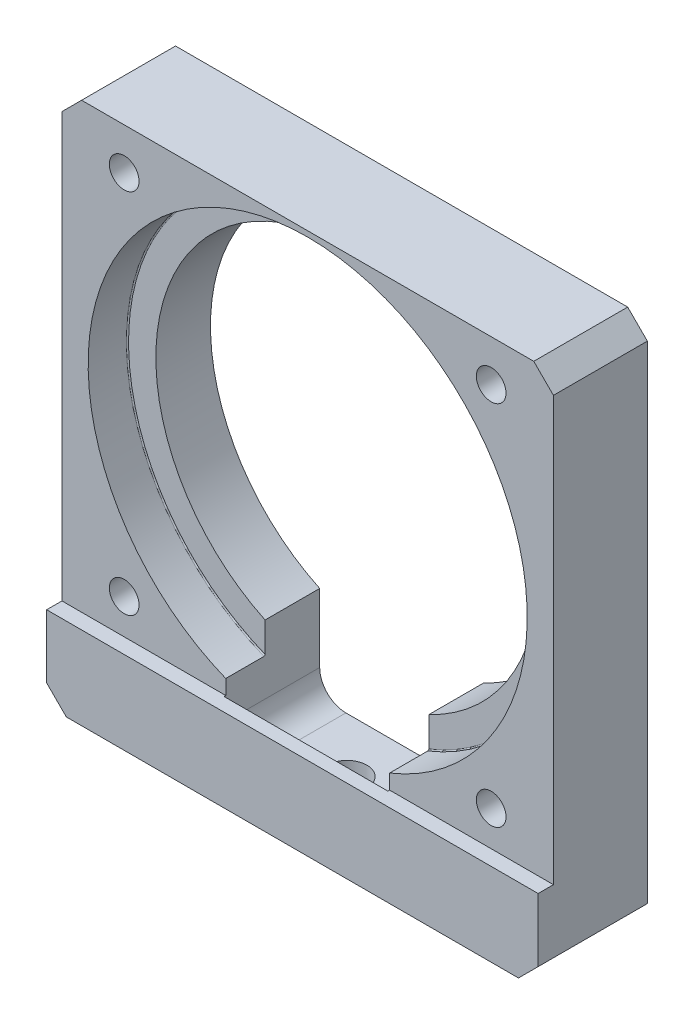
ISO-10303-21;
HEADER;
FILE_DESCRIPTION(('STEP AP214'),'2;1');
FILE_NAME('part.step','',(''),(''),'','','');
FILE_SCHEMA(('AUTOMOTIVE_DESIGN { 1 0 10303 214 1 1 1 1 }'));
ENDSEC;
DATA;
#1=APPLICATION_CONTEXT('core data for automotive mechanical design processes');
#2=APPLICATION_PROTOCOL_DEFINITION('international standard','automotive_design',2000,#1);
#3=PRODUCT_CONTEXT('',#1,'mechanical');
#4=PRODUCT('Part','Part','',(#3));
#5=PRODUCT_RELATED_PRODUCT_CATEGORY('part','',(#4));
#6=PRODUCT_DEFINITION_FORMATION('','',#4);
#7=PRODUCT_DEFINITION_CONTEXT('part definition',#1,'design');
#8=PRODUCT_DEFINITION('design','',#6,#7);
#9=PRODUCT_DEFINITION_SHAPE('','',#8);
#10=(LENGTH_UNIT() NAMED_UNIT(*) SI_UNIT(.MILLI.,.METRE.));
#11=(NAMED_UNIT(*) PLANE_ANGLE_UNIT() SI_UNIT($,.RADIAN.));
#12=(NAMED_UNIT(*) SI_UNIT($,.STERADIAN.) SOLID_ANGLE_UNIT());
#13=UNCERTAINTY_MEASURE_WITH_UNIT(LENGTH_MEASURE(1.E-05),#10,'distance_accuracy_value','');
#14=(GEOMETRIC_REPRESENTATION_CONTEXT(3) GLOBAL_UNCERTAINTY_ASSIGNED_CONTEXT((#13)) GLOBAL_UNIT_ASSIGNED_CONTEXT((#10,
#11,#12)) REPRESENTATION_CONTEXT('',''));
#15=CARTESIAN_POINT('',(0.,0.,0.));
#16=DIRECTION('',(0.,0.,1.));
#17=DIRECTION('',(1.,0.,0.));
#18=AXIS2_PLACEMENT_3D('',#15,#16,#17);
#19=CARTESIAN_POINT('',(0.,61.214,-6.35));
#20=DIRECTION('',(0.,0.,-1.));
#21=DIRECTION('',(-1.,0.,0.));
#22=AXIS2_PLACEMENT_3D('',#19,#20,#21);
#23=PLANE('',#22);
#24=DIRECTION('',(0.,1.,0.));
#25=VECTOR('',#24,1.);
#26=CARTESIAN_POINT('',(19.05,7.0104,-6.35));
#27=LINE('',#26,#25);
#28=CARTESIAN_POINT('',(19.05,7.0104,-6.35));
#29=VERTEX_POINT('',#28);
#30=CARTESIAN_POINT('',(19.05,14.9715368579308,-6.35));
#31=VERTEX_POINT('',#30);
#32=EDGE_CURVE('E436',#29,#31,#27,.T.);
#33=ORIENTED_EDGE('',*,*,#32,.F.);
#34=CARTESIAN_POINT('',(22.098,7.0104,-6.35));
#35=DIRECTION('',(0.,0.,-1.));
#36=DIRECTION('',(-1.,0.,0.));
#37=AXIS2_PLACEMENT_3D('',#34,#35,#36);
#38=CIRCLE('',#37,3.048);
#39=CARTESIAN_POINT('',(22.098,3.9624,-6.35));
#40=VERTEX_POINT('',#39);
#41=EDGE_CURVE('E441',#40,#29,#38,.T.);
#42=ORIENTED_EDGE('',*,*,#41,.F.);
#43=DIRECTION('',(-1.,0.,0.));
#44=VECTOR('',#43,1.);
#45=CARTESIAN_POINT('',(35.052,3.9624,-6.35));
#46=LINE('',#45,#44);
#47=CARTESIAN_POINT('',(35.052,3.96240000000001,-6.35));
#48=VERTEX_POINT('',#47);
#49=EDGE_CURVE('E460',#48,#40,#46,.T.);
#50=ORIENTED_EDGE('',*,*,#49,.F.);
#51=CARTESIAN_POINT('',(35.052,7.0104,-6.35));
#52=DIRECTION('',(0.,0.,-1.));
#53=DIRECTION('',(-1.,0.,0.));
#54=AXIS2_PLACEMENT_3D('',#51,#52,#53);
#55=CIRCLE('',#54,3.04799999999999);
#56=CARTESIAN_POINT('',(38.1,7.0104,-6.35));
#57=VERTEX_POINT('',#56);
#58=EDGE_CURVE('E457',#57,#48,#55,.T.);
#59=ORIENTED_EDGE('',*,*,#58,.F.);
#60=DIRECTION('',(0.,-1.,0.));
#61=VECTOR('',#60,1.);
#62=CARTESIAN_POINT('',(38.1,7.0104,-6.35));
#63=LINE('',#62,#61);
#64=CARTESIAN_POINT('',(38.1,14.9715368579308,-6.35));
#65=VERTEX_POINT('',#64);
#66=EDGE_CURVE('E455',#65,#57,#63,.T.);
#67=ORIENTED_EDGE('',*,*,#66,.F.);
#68=CARTESIAN_POINT('',(28.575,35.052,-6.35));
#69=DIRECTION('',(0.,0.,1.));
#70=DIRECTION('',(1.,0.,0.));
#71=AXIS2_PLACEMENT_3D('',#68,#69,#70);
#72=CIRCLE('',#71,22.225);
#73=EDGE_CURVE('E365',#65,#31,#72,.T.);
#74=ORIENTED_EDGE('',*,*,#73,.T.);
#75=EDGE_LOOP('',(#33,#42,#50,#59,#67,#74));
#76=FACE_BOUND('',#75,.T.);
#77=CARTESIAN_POINT('',(49.911,13.716,-6.35));
#78=DIRECTION('',(0.,0.,1.));
#79=DIRECTION('',(1.,0.,0.));
#80=AXIS2_PLACEMENT_3D('',#77,#78,#79);
#81=CIRCLE('',#80,1.7272);
#82=CARTESIAN_POINT('',(51.6382,13.716,-6.35));
#83=VERTEX_POINT('',#82);
#84=EDGE_CURVE('E418',#83,#83,#81,.T.);
#85=ORIENTED_EDGE('',*,*,#84,.T.);
#86=EDGE_LOOP('',(#85));
#87=FACE_BOUND('',#86,.T.);
#88=CARTESIAN_POINT('',(7.239,13.716,-6.35));
#89=DIRECTION('',(0.,0.,1.));
#90=DIRECTION('',(1.,0.,0.));
#91=AXIS2_PLACEMENT_3D('',#88,#89,#90);
#92=CIRCLE('',#91,1.7272);
#93=CARTESIAN_POINT('',(8.9662,13.716,-6.35));
#94=VERTEX_POINT('',#93);
#95=EDGE_CURVE('E412',#94,#94,#92,.T.);
#96=ORIENTED_EDGE('',*,*,#95,.T.);
#97=EDGE_LOOP('',(#96));
#98=FACE_BOUND('',#97,.T.);
#99=CARTESIAN_POINT('',(49.911,56.388,-6.35));
#100=DIRECTION('',(0.,0.,1.));
#101=DIRECTION('',(1.,0.,0.));
#102=AXIS2_PLACEMENT_3D('',#99,#100,#101);
#103=CIRCLE('',#102,1.7272);
#104=CARTESIAN_POINT('',(51.6382,56.388,-6.35));
#105=VERTEX_POINT('',#104);
#106=EDGE_CURVE('E406',#105,#105,#103,.T.);
#107=ORIENTED_EDGE('',*,*,#106,.T.);
#108=EDGE_LOOP('',(#107));
#109=FACE_BOUND('',#108,.T.);
#110=CARTESIAN_POINT('',(7.23899999999999,56.388,-6.35));
#111=DIRECTION('',(0.,0.,1.));
#112=DIRECTION('',(1.,0.,0.));
#113=AXIS2_PLACEMENT_3D('',#110,#111,#112);
#114=CIRCLE('',#113,1.7272);
#115=CARTESIAN_POINT('',(8.96619999999999,56.388,-6.35));
#116=VERTEX_POINT('',#115);
#117=EDGE_CURVE('E400',#116,#116,#114,.T.);
#118=ORIENTED_EDGE('',*,*,#117,.T.);
#119=EDGE_LOOP('',(#118));
#120=FACE_BOUND('',#119,.T.);
#121=DIRECTION('',(0.,1.,0.));
#122=VECTOR('',#121,1.);
#123=CARTESIAN_POINT('',(57.15,0.,-6.35));
#124=LINE('',#123,#122);
#125=CARTESIAN_POINT('',(57.15,2.286,-6.35));
#126=VERTEX_POINT('',#125);
#127=CARTESIAN_POINT('',(57.15,58.928,-6.35));
#128=VERTEX_POINT('',#127);
#129=EDGE_CURVE('E213',#126,#128,#124,.T.);
#130=ORIENTED_EDGE('',*,*,#129,.F.);
#131=DIRECTION('',(1.,0.,0.));
#132=VECTOR('',#131,1.);
#133=CARTESIAN_POINT('',(0.,2.286,-6.35));
#134=LINE('',#133,#132);
#135=CARTESIAN_POINT('',(0.,2.286,-6.35));
#136=VERTEX_POINT('',#135);
#137=EDGE_CURVE('E198',#136,#126,#134,.T.);
#138=ORIENTED_EDGE('',*,*,#137,.F.);
#139=DIRECTION('',(0.,-1.,0.));
#140=VECTOR('',#139,1.);
#141=CARTESIAN_POINT('',(0.,0.,-6.35));
#142=LINE('',#141,#140);
#143=CARTESIAN_POINT('',(0.,58.928,-6.35));
#144=VERTEX_POINT('',#143);
#145=EDGE_CURVE('E211',#144,#136,#142,.T.);
#146=ORIENTED_EDGE('',*,*,#145,.F.);
#147=DIRECTION('',(-0.707106781186549,-0.707106781186546,0.));
#148=VECTOR('',#147,1.);
#149=CARTESIAN_POINT('',(1.14299999999999,60.071,-6.35));
#150=LINE('',#149,#148);
#151=CARTESIAN_POINT('',(2.286,61.214,-6.35));
#152=VERTEX_POINT('',#151);
#153=EDGE_CURVE('E253',#144,#152,#150,.F.);
#154=ORIENTED_EDGE('',*,*,#153,.T.);
#155=DIRECTION('',(-1.,0.,0.));
#156=VECTOR('',#155,1.);
#157=CARTESIAN_POINT('',(0.,61.214,-6.35));
#158=LINE('',#157,#156);
#159=CARTESIAN_POINT('',(54.864,61.214,-6.35));
#160=VERTEX_POINT('',#159);
#161=EDGE_CURVE('E224',#160,#152,#158,.T.);
#162=ORIENTED_EDGE('',*,*,#161,.F.);
#163=DIRECTION('',(-0.707106781186545,0.70710678118655,0.));
#164=VECTOR('',#163,1.);
#165=CARTESIAN_POINT('',(27.4320000000002,88.646,-6.35));
#166=LINE('',#165,#164);
#167=EDGE_CURVE('E255',#160,#128,#166,.F.);
#168=ORIENTED_EDGE('',*,*,#167,.T.);
#169=EDGE_LOOP('',(#130,#138,#146,#154,#162,#168));
#170=FACE_BOUND('',#169,.T.);
#171=ADVANCED_FACE('F44',(#76,#87,#98,#109,#120,#170),#23,.T.);
#172=CARTESIAN_POINT('',(28.575,35.052,4.572));
#173=DIRECTION('',(0.,0.,1.));
#174=DIRECTION('',(1.,0.,0.));
#175=AXIS2_PLACEMENT_3D('',#172,#173,#174);
#176=CYLINDRICAL_SURFACE('',#175,22.225);
#177=CARTESIAN_POINT('',(28.575,35.052,0.));
#178=DIRECTION('',(0.,0.,1.));
#179=DIRECTION('',(1.,0.,0.));
#180=AXIS2_PLACEMENT_3D('',#177,#178,#179);
#181=CIRCLE('',#180,22.225);
#182=CARTESIAN_POINT('',(19.05,14.9715368579308,0.));
#183=VERTEX_POINT('',#182);
#184=CARTESIAN_POINT('',(38.1,14.9715368579308,0.));
#185=VERTEX_POINT('',#184);
#186=EDGE_CURVE('E424',#183,#185,#181,.F.);
#187=ORIENTED_EDGE('',*,*,#186,.F.);
#188=DIRECTION('',(0.,0.,1.));
#189=VECTOR('',#188,1.);
#190=CARTESIAN_POINT('',(19.05,14.9715368579308,4.572));
#191=LINE('',#190,#189);
#192=EDGE_CURVE('E239',#183,#31,#191,.F.);
#193=ORIENTED_EDGE('',*,*,#192,.T.);
#194=ORIENTED_EDGE('',*,*,#73,.F.);
#195=DIRECTION('',(0.,0.,1.));
#196=VECTOR('',#195,1.);
#197=CARTESIAN_POINT('',(38.1,14.9715368579308,4.572));
#198=LINE('',#197,#196);
#199=EDGE_CURVE('E236',#65,#185,#198,.T.);
#200=ORIENTED_EDGE('',*,*,#199,.T.);
#201=EDGE_LOOP('',(#187,#193,#194,#200));
#202=FACE_BOUND('',#201,.T.);
#203=ADVANCED_FACE('F292',(#202),#176,.F.);
#204=CARTESIAN_POINT('',(0.,61.214,6.35));
#205=DIRECTION('',(0.,-1.,0.));
#206=DIRECTION('',(0.,0.,-1.));
#207=AXIS2_PLACEMENT_3D('',#204,#205,#206);
#208=PLANE('',#207);
#209=DIRECTION('',(-1.,0.,0.));
#210=VECTOR('',#209,1.);
#211=CARTESIAN_POINT('',(0.,61.214,4.572));
#212=LINE('',#211,#210);
#213=CARTESIAN_POINT('',(54.864,61.214,4.572));
#214=VERTEX_POINT('',#213);
#215=CARTESIAN_POINT('',(2.286,61.214,4.572));
#216=VERTEX_POINT('',#215);
#217=EDGE_CURVE('E356',#214,#216,#212,.T.);
#218=ORIENTED_EDGE('',*,*,#217,.F.);
#219=DIRECTION('',(0.,0.,-1.));
#220=VECTOR('',#219,1.);
#221=CARTESIAN_POINT('',(54.864,61.214,6.35));
#222=LINE('',#221,#220);
#223=EDGE_CURVE('E250',#214,#160,#222,.T.);
#224=ORIENTED_EDGE('',*,*,#223,.T.);
#225=ORIENTED_EDGE('',*,*,#161,.T.);
#226=DIRECTION('',(0.,0.,1.));
#227=VECTOR('',#226,1.);
#228=CARTESIAN_POINT('',(2.286,61.214,6.35));
#229=LINE('',#228,#227);
#230=EDGE_CURVE('E248',#152,#216,#229,.T.);
#231=ORIENTED_EDGE('',*,*,#230,.T.);
#232=EDGE_LOOP('',(#218,#224,#225,#231));
#233=FACE_BOUND('',#232,.T.);
#234=ADVANCED_FACE('F295',(#233),#208,.F.);
#235=CARTESIAN_POINT('',(0.,0.,6.35));
#236=DIRECTION('',(1.,0.,0.));
#237=DIRECTION('',(0.,1.,0.));
#238=AXIS2_PLACEMENT_3D('',#235,#236,#237);
#239=PLANE('',#238);
#240=ORIENTED_EDGE('',*,*,#145,.T.);
#241=DIRECTION('',(0.,0.,1.));
#242=VECTOR('',#241,1.);
#243=CARTESIAN_POINT('',(0.,2.28600000000002,6.35));
#244=LINE('',#243,#242);
#245=CARTESIAN_POINT('',(0.,2.28600000000002,-3.175));
#246=VERTEX_POINT('',#245);
#247=EDGE_CURVE('E195',#136,#246,#244,.T.);
#248=ORIENTED_EDGE('',*,*,#247,.T.);
#249=CARTESIAN_POINT('',(0.,2.28600000000002,6.35));
#250=VERTEX_POINT('',#249);
#251=EDGE_CURVE('E206',#246,#250,#244,.T.);
#252=ORIENTED_EDGE('',*,*,#251,.T.);
#253=DIRECTION('',(0.,-1.,0.));
#254=VECTOR('',#253,1.);
#255=CARTESIAN_POINT('',(0.,0.,6.35));
#256=LINE('',#255,#254);
#257=CARTESIAN_POINT('',(0.,9.652,6.35));
#258=VERTEX_POINT('',#257);
#259=EDGE_CURVE('E235',#258,#250,#256,.T.);
#260=ORIENTED_EDGE('',*,*,#259,.F.);
#261=DIRECTION('',(0.,0.,1.));
#262=VECTOR('',#261,1.);
#263=CARTESIAN_POINT('',(0.,9.65200000000001,4.572));
#264=LINE('',#263,#262);
#265=CARTESIAN_POINT('',(0.,9.65200000000001,4.572));
#266=VERTEX_POINT('',#265);
#267=EDGE_CURVE('E227',#266,#258,#264,.T.);
#268=ORIENTED_EDGE('',*,*,#267,.F.);
#269=DIRECTION('',(0.,-1.,0.));
#270=VECTOR('',#269,1.);
#271=CARTESIAN_POINT('',(0.,61.214,4.572));
#272=LINE('',#271,#270);
#273=CARTESIAN_POINT('',(0.,58.928,4.572));
#274=VERTEX_POINT('',#273);
#275=EDGE_CURVE('E353',#274,#266,#272,.T.);
#276=ORIENTED_EDGE('',*,*,#275,.F.);
#277=DIRECTION('',(0.,0.,-1.));
#278=VECTOR('',#277,1.);
#279=CARTESIAN_POINT('',(0.,58.928,6.35));
#280=LINE('',#279,#278);
#281=EDGE_CURVE('E221',#274,#144,#280,.T.);
#282=ORIENTED_EDGE('',*,*,#281,.T.);
#283=EDGE_LOOP('',(#240,#248,#252,#260,#268,#276,#282));
#284=FACE_BOUND('',#283,.T.);
#285=ADVANCED_FACE('F218',(#284),#239,.F.);
#286=CARTESIAN_POINT('',(0.,0.,6.35));
#287=DIRECTION('',(0.,1.,0.));
#288=DIRECTION('',(0.,0.,1.));
#289=AXIS2_PLACEMENT_3D('',#286,#287,#288);
#290=PLANE('',#289);
#291=CARTESIAN_POINT('',(28.575,0.,0.));
#292=DIRECTION('',(0.,1.,0.));
#293=DIRECTION('',(0.,0.,1.));
#294=AXIS2_PLACEMENT_3D('',#291,#292,#293);
#295=CIRCLE('',#294,2.3114);
#296=CARTESIAN_POINT('',(28.575,0.,2.31139999999999));
#297=VERTEX_POINT('',#296);
#298=EDGE_CURVE('E433',#297,#297,#295,.T.);
#299=ORIENTED_EDGE('',*,*,#298,.T.);
#300=EDGE_LOOP('',(#299));
#301=FACE_BOUND('',#300,.T.);
#302=DIRECTION('',(0.,0.,-1.));
#303=VECTOR('',#302,1.);
#304=CARTESIAN_POINT('',(2.28600000000001,0.,6.35));
#305=LINE('',#304,#303);
#306=CARTESIAN_POINT('',(2.28600000000001,0.,6.35));
#307=VERTEX_POINT('',#306);
#308=CARTESIAN_POINT('',(2.28600000000001,0.,-3.175));
#309=VERTEX_POINT('',#308);
#310=EDGE_CURVE('E266',#307,#309,#305,.T.);
#311=ORIENTED_EDGE('',*,*,#310,.T.);
#312=DIRECTION('',(-1.,0.,0.));
#313=VECTOR('',#312,1.);
#314=CARTESIAN_POINT('',(0.,0.,-3.175));
#315=LINE('',#314,#313);
#316=CARTESIAN_POINT('',(54.864,0.,-3.175));
#317=VERTEX_POINT('',#316);
#318=EDGE_CURVE('E215',#317,#309,#315,.T.);
#319=ORIENTED_EDGE('',*,*,#318,.F.);
#320=DIRECTION('',(0.,0.,1.));
#321=VECTOR('',#320,1.);
#322=CARTESIAN_POINT('',(54.864,0.,6.35));
#323=LINE('',#322,#321);
#324=CARTESIAN_POINT('',(54.864,0.,6.35));
#325=VERTEX_POINT('',#324);
#326=EDGE_CURVE('E269',#317,#325,#323,.T.);
#327=ORIENTED_EDGE('',*,*,#326,.T.);
#328=DIRECTION('',(1.,0.,0.));
#329=VECTOR('',#328,1.);
#330=CARTESIAN_POINT('',(0.,0.,6.35));
#331=LINE('',#330,#329);
#332=EDGE_CURVE('E375',#307,#325,#331,.T.);
#333=ORIENTED_EDGE('',*,*,#332,.F.);
#334=EDGE_LOOP('',(#311,#319,#327,#333));
#335=FACE_BOUND('',#334,.T.);
#336=ADVANCED_FACE('F318',(#301,#335),#290,.F.);
#337=CARTESIAN_POINT('',(57.15,0.,6.35));
#338=DIRECTION('',(-1.,0.,0.));
#339=DIRECTION('',(0.,-1.,0.));
#340=AXIS2_PLACEMENT_3D('',#337,#338,#339);
#341=PLANE('',#340);
#342=ORIENTED_EDGE('',*,*,#129,.T.);
#343=DIRECTION('',(0.,0.,1.));
#344=VECTOR('',#343,1.);
#345=CARTESIAN_POINT('',(57.15,58.928,6.35));
#346=LINE('',#345,#344);
#347=CARTESIAN_POINT('',(57.15,58.928,4.572));
#348=VERTEX_POINT('',#347);
#349=EDGE_CURVE('E260',#128,#348,#346,.T.);
#350=ORIENTED_EDGE('',*,*,#349,.T.);
#351=DIRECTION('',(0.,1.,0.));
#352=VECTOR('',#351,1.);
#353=CARTESIAN_POINT('',(57.15,61.214,4.572));
#354=LINE('',#353,#352);
#355=CARTESIAN_POINT('',(57.15,9.65200000000001,4.572));
#356=VERTEX_POINT('',#355);
#357=EDGE_CURVE('E370',#356,#348,#354,.T.);
#358=ORIENTED_EDGE('',*,*,#357,.F.);
#359=DIRECTION('',(0.,0.,1.));
#360=VECTOR('',#359,1.);
#361=CARTESIAN_POINT('',(57.15,9.65200000000001,4.572));
#362=LINE('',#361,#360);
#363=CARTESIAN_POINT('',(57.15,9.65200000000001,6.35));
#364=VERTEX_POINT('',#363);
#365=EDGE_CURVE('E222',#356,#364,#362,.T.);
#366=ORIENTED_EDGE('',*,*,#365,.T.);
#367=DIRECTION('',(0.,1.,0.));
#368=VECTOR('',#367,1.);
#369=CARTESIAN_POINT('',(57.15,0.,6.35));
#370=LINE('',#369,#368);
#371=CARTESIAN_POINT('',(57.15,2.286,6.35));
#372=VERTEX_POINT('',#371);
#373=EDGE_CURVE('E230',#372,#364,#370,.T.);
#374=ORIENTED_EDGE('',*,*,#373,.F.);
#375=DIRECTION('',(0.,0.,-1.));
#376=VECTOR('',#375,1.);
#377=CARTESIAN_POINT('',(57.15,2.286,6.35));
#378=LINE('',#377,#376);
#379=CARTESIAN_POINT('',(57.15,2.286,-3.175));
#380=VERTEX_POINT('',#379);
#381=EDGE_CURVE('E257',#372,#380,#378,.T.);
#382=ORIENTED_EDGE('',*,*,#381,.T.);
#383=DIRECTION('',(0.,0.,1.));
#384=VECTOR('',#383,1.);
#385=CARTESIAN_POINT('',(57.15,2.286,-3.175));
#386=LINE('',#385,#384);
#387=EDGE_CURVE('E214',#126,#380,#386,.T.);
#388=ORIENTED_EDGE('',*,*,#387,.F.);
#389=EDGE_LOOP('',(#342,#350,#358,#366,#374,#382,#388));
#390=FACE_BOUND('',#389,.T.);
#391=ADVANCED_FACE('F308',(#390),#341,.F.);
#392=CARTESIAN_POINT('',(0.,61.214,6.35));
#393=DIRECTION('',(0.,0.,-1.));
#394=DIRECTION('',(-1.,0.,0.));
#395=AXIS2_PLACEMENT_3D('',#392,#393,#394);
#396=PLANE('',#395);
#397=ORIENTED_EDGE('',*,*,#332,.T.);
#398=DIRECTION('',(-0.707106781186549,-0.707106781186546,0.));
#399=VECTOR('',#398,1.);
#400=CARTESIAN_POINT('',(57.15,2.286,6.35));
#401=LINE('',#400,#399);
#402=EDGE_CURVE('E273',#325,#372,#401,.F.);
#403=ORIENTED_EDGE('',*,*,#402,.T.);
#404=ORIENTED_EDGE('',*,*,#373,.T.);
#405=DIRECTION('',(1.,0.,0.));
#406=VECTOR('',#405,1.);
#407=CARTESIAN_POINT('',(0.,9.65200000000001,6.35));
#408=LINE('',#407,#406);
#409=EDGE_CURVE('E360',#258,#364,#408,.T.);
#410=ORIENTED_EDGE('',*,*,#409,.F.);
#411=ORIENTED_EDGE('',*,*,#259,.T.);
#412=DIRECTION('',(-0.707106781186546,0.707106781186549,0.));
#413=VECTOR('',#412,1.);
#414=CARTESIAN_POINT('',(2.28600000000001,0.,6.35));
#415=LINE('',#414,#413);
#416=EDGE_CURVE('E271',#250,#307,#415,.F.);
#417=ORIENTED_EDGE('',*,*,#416,.T.);
#418=EDGE_LOOP('',(#397,#403,#404,#410,#411,#417));
#419=FACE_BOUND('',#418,.T.);
#420=ADVANCED_FACE('F304',(#419),#396,.F.);
#421=CARTESIAN_POINT('',(0.,9.65200000000001,4.572));
#422=DIRECTION('',(0.,-1.,0.));
#423=DIRECTION('',(0.,0.,-1.));
#424=AXIS2_PLACEMENT_3D('',#421,#422,#423);
#425=PLANE('',#424);
#426=DIRECTION('',(1.,0.,0.));
#427=VECTOR('',#426,1.);
#428=CARTESIAN_POINT('',(0.,9.65200000000001,4.7752));
#429=LINE('',#428,#427);
#430=CARTESIAN_POINT('',(19.05,9.65200000000001,4.7752));
#431=VERTEX_POINT('',#430);
#432=CARTESIAN_POINT('',(38.1,9.65200000000001,4.7752));
#433=VERTEX_POINT('',#432);
#434=EDGE_CURVE('E241',#431,#433,#429,.T.);
#435=ORIENTED_EDGE('',*,*,#434,.F.);
#436=DIRECTION('',(0.,0.,-1.));
#437=VECTOR('',#436,1.);
#438=CARTESIAN_POINT('',(19.05,9.65200000000001,4.572));
#439=LINE('',#438,#437);
#440=CARTESIAN_POINT('',(19.05,9.65200000000001,4.572));
#441=VERTEX_POINT('',#440);
#442=EDGE_CURVE('E480',#431,#441,#439,.T.);
#443=ORIENTED_EDGE('',*,*,#442,.T.);
#444=DIRECTION('',(1.,0.,0.));
#445=VECTOR('',#444,1.);
#446=CARTESIAN_POINT('',(0.,9.65200000000001,4.572));
#447=LINE('',#446,#445);
#448=EDGE_CURVE('E362',#266,#441,#447,.T.);
#449=ORIENTED_EDGE('',*,*,#448,.F.);
#450=ORIENTED_EDGE('',*,*,#267,.T.);
#451=ORIENTED_EDGE('',*,*,#409,.T.);
#452=ORIENTED_EDGE('',*,*,#365,.F.);
#453=CARTESIAN_POINT('',(38.1,9.65200000000001,4.572));
#454=VERTEX_POINT('',#453);
#455=EDGE_CURVE('E359',#454,#356,#447,.T.);
#456=ORIENTED_EDGE('',*,*,#455,.F.);
#457=DIRECTION('',(0.,0.,1.));
#458=VECTOR('',#457,1.);
#459=CARTESIAN_POINT('',(38.1,9.65200000000001,4.572));
#460=LINE('',#459,#458);
#461=EDGE_CURVE('E476',#454,#433,#460,.T.);
#462=ORIENTED_EDGE('',*,*,#461,.T.);
#463=EDGE_LOOP('',(#435,#443,#449,#450,#451,#452,#456,#462));
#464=FACE_BOUND('',#463,.T.);
#465=ADVANCED_FACE('F300',(#464),#425,.F.);
#466=CARTESIAN_POINT('',(0.,9.65200000000001,4.572));
#467=DIRECTION('',(0.,0.,1.));
#468=DIRECTION('',(1.,0.,0.));
#469=AXIS2_PLACEMENT_3D('',#466,#467,#468);
#470=PLANE('',#469);
#471=CARTESIAN_POINT('',(7.23899999999999,56.388,4.572));
#472=DIRECTION('',(0.,0.,1.));
#473=DIRECTION('',(1.,0.,0.));
#474=AXIS2_PLACEMENT_3D('',#471,#472,#473);
#475=CIRCLE('',#474,1.72719999999999);
#476=CARTESIAN_POINT('',(8.96619999999998,56.388,4.572));
#477=VERTEX_POINT('',#476);
#478=EDGE_CURVE('E397',#477,#477,#475,.T.);
#479=ORIENTED_EDGE('',*,*,#478,.F.);
#480=EDGE_LOOP('',(#479));
#481=FACE_BOUND('',#480,.T.);
#482=CARTESIAN_POINT('',(49.911,56.388,4.572));
#483=DIRECTION('',(0.,0.,1.));
#484=DIRECTION('',(1.,0.,0.));
#485=AXIS2_PLACEMENT_3D('',#482,#483,#484);
#486=CIRCLE('',#485,1.72719999999998);
#487=CARTESIAN_POINT('',(51.6382,56.388,4.572));
#488=VERTEX_POINT('',#487);
#489=EDGE_CURVE('E403',#488,#488,#486,.T.);
#490=ORIENTED_EDGE('',*,*,#489,.F.);
#491=EDGE_LOOP('',(#490));
#492=FACE_BOUND('',#491,.T.);
#493=CARTESIAN_POINT('',(7.239,13.716,4.572));
#494=DIRECTION('',(0.,0.,1.));
#495=DIRECTION('',(1.,0.,0.));
#496=AXIS2_PLACEMENT_3D('',#493,#494,#495);
#497=CIRCLE('',#496,1.72719999999999);
#498=CARTESIAN_POINT('',(8.96619999999999,13.716,4.572));
#499=VERTEX_POINT('',#498);
#500=EDGE_CURVE('E409',#499,#499,#497,.T.);
#501=ORIENTED_EDGE('',*,*,#500,.F.);
#502=EDGE_LOOP('',(#501));
#503=FACE_BOUND('',#502,.T.);
#504=CARTESIAN_POINT('',(49.911,13.716,4.572));
#505=DIRECTION('',(0.,0.,1.));
#506=DIRECTION('',(1.,0.,0.));
#507=AXIS2_PLACEMENT_3D('',#504,#505,#506);
#508=CIRCLE('',#507,1.72719999999999);
#509=CARTESIAN_POINT('',(51.6382,13.716,4.572));
#510=VERTEX_POINT('',#509);
#511=EDGE_CURVE('E415',#510,#510,#508,.T.);
#512=ORIENTED_EDGE('',*,*,#511,.F.);
#513=EDGE_LOOP('',(#512));
#514=FACE_BOUND('',#513,.T.);
#515=ORIENTED_EDGE('',*,*,#357,.T.);
#516=DIRECTION('',(0.707106781186545,-0.70710678118655,0.));
#517=VECTOR('',#516,1.);
#518=CARTESIAN_POINT('',(53.2130000000002,62.8649999999999,4.572));
#519=LINE('',#518,#517);
#520=EDGE_CURVE('E264',#348,#214,#519,.F.);
#521=ORIENTED_EDGE('',*,*,#520,.T.);
#522=ORIENTED_EDGE('',*,*,#217,.T.);
#523=DIRECTION('',(0.707106781186549,0.707106781186546,0.));
#524=VECTOR('',#523,1.);
#525=CARTESIAN_POINT('',(-24.638,34.2900000000001,4.572));
#526=LINE('',#525,#524);
#527=EDGE_CURVE('E262',#216,#274,#526,.F.);
#528=ORIENTED_EDGE('',*,*,#527,.T.);
#529=ORIENTED_EDGE('',*,*,#275,.T.);
#530=ORIENTED_EDGE('',*,*,#448,.T.);
#531=DIRECTION('',(0.,-1.,0.));
#532=VECTOR('',#531,1.);
#533=CARTESIAN_POINT('',(19.05,9.65200000000002,4.572));
#534=LINE('',#533,#532);
#535=CARTESIAN_POINT('',(19.05,11.3686281116898,4.572));
#536=VERTEX_POINT('',#535);
#537=EDGE_CURVE('E479',#536,#441,#534,.T.);
#538=ORIENTED_EDGE('',*,*,#537,.F.);
#539=CARTESIAN_POINT('',(28.575,35.052,4.572));
#540=DIRECTION('',(0.,0.,1.));
#541=DIRECTION('',(1.,0.,0.));
#542=AXIS2_PLACEMENT_3D('',#539,#540,#541);
#543=CIRCLE('',#542,25.527);
#544=CARTESIAN_POINT('',(38.1,11.3686281116898,4.572));
#545=VERTEX_POINT('',#544);
#546=EDGE_CURVE('E421',#545,#536,#543,.T.);
#547=ORIENTED_EDGE('',*,*,#546,.F.);
#548=DIRECTION('',(0.,1.,0.));
#549=VECTOR('',#548,1.);
#550=CARTESIAN_POINT('',(38.1,9.65199999999999,4.572));
#551=LINE('',#550,#549);
#552=EDGE_CURVE('E467',#454,#545,#551,.T.);
#553=ORIENTED_EDGE('',*,*,#552,.F.);
#554=ORIENTED_EDGE('',*,*,#455,.T.);
#555=EDGE_LOOP('',(#515,#521,#522,#528,#529,#530,#538,#547,#553,#554));
#556=FACE_BOUND('',#555,.T.);
#557=ADVANCED_FACE('F297',(#481,#492,#503,#514,#556),#470,.T.);
#558=CARTESIAN_POINT('',(35.052,7.0104,4.7752));
#559=DIRECTION('',(0.,0.,-1.));
#560=DIRECTION('',(-1.,0.,0.));
#561=AXIS2_PLACEMENT_3D('',#558,#559,#560);
#562=PLANE('',#561);
#563=ORIENTED_EDGE('',*,*,#434,.T.);
#564=DIRECTION('',(0.,-1.,0.));
#565=VECTOR('',#564,1.);
#566=CARTESIAN_POINT('',(38.1,7.0104,4.7752));
#567=LINE('',#566,#565);
#568=CARTESIAN_POINT('',(38.1,7.0104,4.7752));
#569=VERTEX_POINT('',#568);
#570=EDGE_CURVE('E440',#433,#569,#567,.T.);
#571=ORIENTED_EDGE('',*,*,#570,.T.);
#572=CARTESIAN_POINT('',(35.052,7.0104,4.7752));
#573=DIRECTION('',(0.,0.,-1.));
#574=DIRECTION('',(-1.,0.,0.));
#575=AXIS2_PLACEMENT_3D('',#572,#573,#574);
#576=CIRCLE('',#575,3.04799999999999);
#577=CARTESIAN_POINT('',(35.052,3.96240000000001,4.7752));
#578=VERTEX_POINT('',#577);
#579=EDGE_CURVE('E443',#569,#578,#576,.T.);
#580=ORIENTED_EDGE('',*,*,#579,.T.);
#581=DIRECTION('',(-1.,0.,0.));
#582=VECTOR('',#581,1.);
#583=CARTESIAN_POINT('',(35.052,3.9624,4.7752));
#584=LINE('',#583,#582);
#585=CARTESIAN_POINT('',(22.098,3.9624,4.7752));
#586=VERTEX_POINT('',#585);
#587=EDGE_CURVE('E446',#578,#586,#584,.T.);
#588=ORIENTED_EDGE('',*,*,#587,.T.);
#589=CARTESIAN_POINT('',(22.098,7.0104,4.7752));
#590=DIRECTION('',(0.,0.,-1.));
#591=DIRECTION('',(-1.,0.,0.));
#592=AXIS2_PLACEMENT_3D('',#589,#590,#591);
#593=CIRCLE('',#592,3.048);
#594=CARTESIAN_POINT('',(19.05,7.0104,4.7752));
#595=VERTEX_POINT('',#594);
#596=EDGE_CURVE('E449',#586,#595,#593,.T.);
#597=ORIENTED_EDGE('',*,*,#596,.T.);
#598=DIRECTION('',(0.,1.,0.));
#599=VECTOR('',#598,1.);
#600=CARTESIAN_POINT('',(19.05,7.0104,4.7752));
#601=LINE('',#600,#599);
#602=EDGE_CURVE('E437',#595,#431,#601,.T.);
#603=ORIENTED_EDGE('',*,*,#602,.T.);
#604=EDGE_LOOP('',(#563,#571,#580,#588,#597,#603));
#605=FACE_BOUND('',#604,.T.);
#606=ADVANCED_FACE('F289',(#605),#562,.T.);
#607=CARTESIAN_POINT('',(19.05,7.0104,4.7752));
#608=DIRECTION('',(-1.,0.,0.));
#609=DIRECTION('',(0.,-1.,0.));
#610=AXIS2_PLACEMENT_3D('',#607,#608,#609);
#611=PLANE('',#610);
#612=DIRECTION('',(0.,1.,0.));
#613=VECTOR('',#612,1.);
#614=CARTESIAN_POINT('',(19.05,7.0104,0.));
#615=LINE('',#614,#613);
#616=CARTESIAN_POINT('',(19.05,11.5055698034713,0.));
#617=VERTEX_POINT('',#616);
#618=EDGE_CURVE('E426',#617,#183,#615,.T.);
#619=ORIENTED_EDGE('',*,*,#618,.F.);
#620=CARTESIAN_POINT('',(19.05,11.5055698034713,0.));
#621=CARTESIAN_POINT('',(19.05,11.497402366218,-3.88369309250334E-06));
#622=CARTESIAN_POINT('',(19.05,11.4892330039454,0.000676987066916599));
#623=CARTESIAN_POINT('',(19.05,11.473106536977,0.00338472897518458));
#624=CARTESIAN_POINT('',(19.05,11.465149816328,0.00541388411496085));
#625=CARTESIAN_POINT('',(19.05,11.4496840813221,0.0107979968003139));
#626=CARTESIAN_POINT('',(19.05,11.4421756574833,0.0141546605102948));
#627=CARTESIAN_POINT('',(19.05,11.4278665728541,0.0221300018913593));
#628=CARTESIAN_POINT('',(19.05,11.421065298965,0.0267475735430367));
#629=CARTESIAN_POINT('',(19.05,11.4086709060076,0.0369337225489854));
#630=CARTESIAN_POINT('',(19.05,11.4030400274992,0.0424562405131291));
#631=CARTESIAN_POINT('',(19.05,11.3928740876283,0.054437004293123));
#632=CARTESIAN_POINT('',(19.05,11.38833894461,0.060895180324984));
#633=CARTESIAN_POINT('',(19.05,11.3808560058482,0.0740472673789529));
#634=CARTESIAN_POINT('',(19.05,11.3778158812572,0.0806887584276077));
#635=CARTESIAN_POINT('',(19.05,11.3729855715573,0.0944064541734552));
#636=CARTESIAN_POINT('',(19.05,11.3711932026662,0.101481875676284));
#637=CARTESIAN_POINT('',(19.05,11.3695860667535,0.111688695287357));
#638=CARTESIAN_POINT('',(19.05,11.3692269116705,0.114742215720053));
#639=CARTESIAN_POINT('',(19.05,11.3687481640368,0.120863278219111));
#640=CARTESIAN_POINT('',(19.05,11.3686282058843,0.123930791693009));
#641=CARTESIAN_POINT('',(19.05,11.3686281116898,0.126999999999998));
#642=B_SPLINE_CURVE_WITH_KNOTS('',3,(#620,#621,#622,#623,#624,#625,#626,#627,#628,#629,#630,
#631,#632,#633,#634,#635,#636,#637,#638,#639,#640,#641),.UNSPECIFIED.,.F.,.F.,(4,2,2,2,2,2,2,2,
2,2,4),(0.,0.0244774901897502,0.0489965512815102,0.0735472281485221,0.0980764389110483,
0.121612777837945,0.145147362261823,0.166948092030652,0.188710570278926,0.197926592981863,
0.207128518570787),.UNSPECIFIED.);
#643=CARTESIAN_POINT('',(19.05,11.3686281116898,0.127));
#644=VERTEX_POINT('',#643);
#645=EDGE_CURVE('E57',#617,#644,#642,.T.);
#646=ORIENTED_EDGE('',*,*,#645,.T.);
#647=DIRECTION('',(0.,0.,1.));
#648=VECTOR('',#647,1.);
#649=CARTESIAN_POINT('',(19.05,11.3686281116898,0.));
#650=LINE('',#649,#648);
#651=EDGE_CURVE('E428',#644,#536,#650,.T.);
#652=ORIENTED_EDGE('',*,*,#651,.T.);
#653=ORIENTED_EDGE('',*,*,#537,.T.);
#654=ORIENTED_EDGE('',*,*,#442,.F.);
#655=ORIENTED_EDGE('',*,*,#602,.F.);
#656=DIRECTION('',(0.,0.,-1.));
#657=VECTOR('',#656,1.);
#658=CARTESIAN_POINT('',(19.05,7.0104,4.7752));
#659=LINE('',#658,#657);
#660=EDGE_CURVE('E465',#595,#29,#659,.T.);
#661=ORIENTED_EDGE('',*,*,#660,.T.);
#662=ORIENTED_EDGE('',*,*,#32,.T.);
#663=ORIENTED_EDGE('',*,*,#192,.F.);
#664=EDGE_LOOP('',(#619,#646,#652,#653,#654,#655,#661,#662,#663));
#665=FACE_BOUND('',#664,.T.);
#666=ADVANCED_FACE('F284',(#665),#611,.F.);
#667=CARTESIAN_POINT('',(38.1,7.0104,4.7752));
#668=DIRECTION('',(1.,0.,0.));
#669=DIRECTION('',(0.,1.,0.));
#670=AXIS2_PLACEMENT_3D('',#667,#668,#669);
#671=PLANE('',#670);
#672=ORIENTED_EDGE('',*,*,#552,.T.);
#673=DIRECTION('',(0.,0.,1.));
#674=VECTOR('',#673,1.);
#675=CARTESIAN_POINT('',(38.1,11.3686281116898,0.));
#676=LINE('',#675,#674);
#677=CARTESIAN_POINT('',(38.1,11.3686281116898,0.127));
#678=VERTEX_POINT('',#677);
#679=EDGE_CURVE('E246',#545,#678,#676,.F.);
#680=ORIENTED_EDGE('',*,*,#679,.T.);
#681=CARTESIAN_POINT('',(38.1,11.3686281116898,0.127));
#682=CARTESIAN_POINT('',(38.1,11.3686200001493,0.120226424224569));
#683=CARTESIAN_POINT('',(38.1,11.3692116407377,0.11345764764706));
#684=CARTESIAN_POINT('',(38.1,11.3715308983313,0.100136024659243));
#685=CARTESIAN_POINT('',(38.1,11.3732553860549,0.0935826354930412));
#686=CARTESIAN_POINT('',(38.1,11.3777769231936,0.0808602358882068));
#687=CARTESIAN_POINT('',(38.1,11.3805737289952,0.0746911385144454));
#688=CARTESIAN_POINT('',(38.1,11.3871340842506,0.0628897807303514));
#689=CARTESIAN_POINT('',(38.1,11.3908980055427,0.0572577279484382));
#690=CARTESIAN_POINT('',(38.1,11.3993906082689,0.0465013059455359));
#691=CARTESIAN_POINT('',(38.1,11.4041446229493,0.0413969828895933));
#692=CARTESIAN_POINT('',(38.1,11.4143927869084,0.0319965658557314));
#693=CARTESIAN_POINT('',(38.1,11.4198871199158,0.0277006731466987));
#694=CARTESIAN_POINT('',(38.1,11.4318587788692,0.0197266878918853));
#695=CARTESIAN_POINT('',(38.1,11.438377648948,0.0161110192144569));
#696=CARTESIAN_POINT('',(38.1,11.4519025463975,0.00994470936885436));
#697=CARTESIAN_POINT('',(38.1,11.4589087721654,0.0073945049344599));
#698=CARTESIAN_POINT('',(38.1,11.4724925566006,0.00360110486261795));
#699=CARTESIAN_POINT('',(38.1,11.4790405746449,0.00225083534443309));
#700=CARTESIAN_POINT('',(38.1,11.4922490585074,0.000450273901058924));
#701=CARTESIAN_POINT('',(38.1,11.4989093357004,-1.40028878219212E-06));
#702=CARTESIAN_POINT('',(38.1,11.5055698034713,0.));
#703=B_SPLINE_CURVE_WITH_KNOTS('',3,(#681,#682,#683,#684,#685,#686,#687,#688,#689,#690,#691,
#692,#693,#694,#695,#696,#697,#698,#699,#700,#701,#702),.UNSPECIFIED.,.F.,.F.,(4,2,2,2,2,2,2,2,
2,2,4),(0.,0.0202875026157216,0.0405191990676198,0.0607463019246778,0.080981193403024,
0.101817060818287,0.122658108741556,0.144925855332215,0.167202720538047,0.187199087281039,
0.207164670747642),.UNSPECIFIED.);
#704=CARTESIAN_POINT('',(38.1,11.5055698034713,0.));
#705=VERTEX_POINT('',#704);
#706=EDGE_CURVE('E13',#678,#705,#703,.T.);
#707=ORIENTED_EDGE('',*,*,#706,.T.);
#708=DIRECTION('',(0.,-1.,0.));
#709=VECTOR('',#708,1.);
#710=CARTESIAN_POINT('',(38.1,7.0104,0.));
#711=LINE('',#710,#709);
#712=EDGE_CURVE('E243',#185,#705,#711,.T.);
#713=ORIENTED_EDGE('',*,*,#712,.F.);
#714=ORIENTED_EDGE('',*,*,#199,.F.);
#715=ORIENTED_EDGE('',*,*,#66,.T.);
#716=DIRECTION('',(0.,0.,-1.));
#717=VECTOR('',#716,1.);
#718=CARTESIAN_POINT('',(38.1,7.0104,4.7752));
#719=LINE('',#718,#717);
#720=EDGE_CURVE('E452',#569,#57,#719,.T.);
#721=ORIENTED_EDGE('',*,*,#720,.F.);
#722=ORIENTED_EDGE('',*,*,#570,.F.);
#723=ORIENTED_EDGE('',*,*,#461,.F.);
#724=EDGE_LOOP('',(#672,#680,#707,#713,#714,#715,#721,#722,#723));
#725=FACE_BOUND('',#724,.T.);
#726=ADVANCED_FACE('F288',(#725),#671,.F.);
#727=CARTESIAN_POINT('',(22.098,7.0104,4.7752));
#728=DIRECTION('',(0.,0.,-1.));
#729=DIRECTION('',(-1.,0.,0.));
#730=AXIS2_PLACEMENT_3D('',#727,#728,#729);
#731=CYLINDRICAL_SURFACE('',#730,3.048);
#732=ORIENTED_EDGE('',*,*,#41,.T.);
#733=ORIENTED_EDGE('',*,*,#660,.F.);
#734=ORIENTED_EDGE('',*,*,#596,.F.);
#735=DIRECTION('',(0.,0.,-1.));
#736=VECTOR('',#735,1.);
#737=CARTESIAN_POINT('',(22.098,3.9624,4.7752));
#738=LINE('',#737,#736);
#739=EDGE_CURVE('E468',#586,#40,#738,.T.);
#740=ORIENTED_EDGE('',*,*,#739,.T.);
#741=EDGE_LOOP('',(#732,#733,#734,#740));
#742=FACE_BOUND('',#741,.T.);
#743=ADVANCED_FACE('F494',(#742),#731,.F.);
#744=CARTESIAN_POINT('',(35.052,3.9624,4.7752));
#745=DIRECTION('',(0.,-1.,0.));
#746=DIRECTION('',(0.,0.,-1.));
#747=AXIS2_PLACEMENT_3D('',#744,#745,#746);
#748=PLANE('',#747);
#749=CARTESIAN_POINT('',(28.575,3.9624,0.));
#750=DIRECTION('',(0.,1.,0.));
#751=DIRECTION('',(0.,0.,1.));
#752=AXIS2_PLACEMENT_3D('',#749,#750,#751);
#753=CIRCLE('',#752,2.3114);
#754=CARTESIAN_POINT('',(28.575,3.9624,2.31139999999999));
#755=VERTEX_POINT('',#754);
#756=EDGE_CURVE('E430',#755,#755,#753,.T.);
#757=ORIENTED_EDGE('',*,*,#756,.F.);
#758=EDGE_LOOP('',(#757));
#759=FACE_BOUND('',#758,.T.);
#760=ORIENTED_EDGE('',*,*,#49,.T.);
#761=ORIENTED_EDGE('',*,*,#739,.F.);
#762=ORIENTED_EDGE('',*,*,#587,.F.);
#763=DIRECTION('',(0.,0.,-1.));
#764=VECTOR('',#763,1.);
#765=CARTESIAN_POINT('',(35.052,3.96240000000001,4.7752));
#766=LINE('',#765,#764);
#767=EDGE_CURVE('E470',#578,#48,#766,.T.);
#768=ORIENTED_EDGE('',*,*,#767,.T.);
#769=EDGE_LOOP('',(#760,#761,#762,#768));
#770=FACE_BOUND('',#769,.T.);
#771=ADVANCED_FACE('F497',(#759,#770),#748,.F.);
#772=CARTESIAN_POINT('',(35.052,7.0104,4.7752));
#773=DIRECTION('',(0.,0.,-1.));
#774=DIRECTION('',(-1.,0.,0.));
#775=AXIS2_PLACEMENT_3D('',#772,#773,#774);
#776=CYLINDRICAL_SURFACE('',#775,3.04799999999999);
#777=ORIENTED_EDGE('',*,*,#58,.T.);
#778=ORIENTED_EDGE('',*,*,#767,.F.);
#779=ORIENTED_EDGE('',*,*,#579,.F.);
#780=ORIENTED_EDGE('',*,*,#720,.T.);
#781=EDGE_LOOP('',(#777,#778,#779,#780));
#782=FACE_BOUND('',#781,.T.);
#783=ADVANCED_FACE('F501',(#782),#776,.F.);
#784=CARTESIAN_POINT('',(28.575,3.9624,0.));
#785=DIRECTION('',(0.,1.,0.));
#786=DIRECTION('',(0.,0.,1.));
#787=AXIS2_PLACEMENT_3D('',#784,#785,#786);
#788=CYLINDRICAL_SURFACE('',#787,2.3114);
#789=ORIENTED_EDGE('',*,*,#756,.T.);
#790=EDGE_LOOP('',(#789));
#791=FACE_BOUND('',#790,.T.);
#792=ORIENTED_EDGE('',*,*,#298,.F.);
#793=EDGE_LOOP('',(#792));
#794=FACE_BOUND('',#793,.T.);
#795=ADVANCED_FACE('F538',(#791,#794),#788,.F.);
#796=CARTESIAN_POINT('',(28.575,35.052,0.));
#797=DIRECTION('',(0.,0.,1.));
#798=DIRECTION('',(1.,0.,0.));
#799=AXIS2_PLACEMENT_3D('',#796,#797,#798);
#800=CYLINDRICAL_SURFACE('',#799,25.527);
#801=ORIENTED_EDGE('',*,*,#651,.F.);
#802=CARTESIAN_POINT('',(28.575,35.052,0.127));
#803=DIRECTION('',(0.,0.,1.));
#804=DIRECTION('',(1.,0.,0.));
#805=AXIS2_PLACEMENT_3D('',#802,#803,#804);
#806=CIRCLE('',#805,25.527);
#807=EDGE_CURVE('E70',#644,#678,#806,.F.);
#808=ORIENTED_EDGE('',*,*,#807,.T.);
#809=ORIENTED_EDGE('',*,*,#679,.F.);
#810=ORIENTED_EDGE('',*,*,#546,.T.);
#811=EDGE_LOOP('',(#801,#808,#809,#810));
#812=FACE_BOUND('',#811,.T.);
#813=ADVANCED_FACE('F535',(#812),#800,.F.);
#814=CARTESIAN_POINT('',(28.575,35.052,0.));
#815=DIRECTION('',(0.,0.,1.));
#816=DIRECTION('',(1.,0.,0.));
#817=AXIS2_PLACEMENT_3D('',#814,#815,#816);
#818=PLANE('',#817);
#819=ORIENTED_EDGE('',*,*,#712,.T.);
#820=CARTESIAN_POINT('',(28.575,35.052,0.));
#821=DIRECTION('',(0.,0.,1.));
#822=DIRECTION('',(1.,0.,0.));
#823=AXIS2_PLACEMENT_3D('',#820,#821,#822);
#824=CIRCLE('',#823,25.4);
#825=EDGE_CURVE('E277',#705,#617,#824,.T.);
#826=ORIENTED_EDGE('',*,*,#825,.T.);
#827=ORIENTED_EDGE('',*,*,#618,.T.);
#828=ORIENTED_EDGE('',*,*,#186,.T.);
#829=EDGE_LOOP('',(#819,#826,#827,#828));
#830=FACE_BOUND('',#829,.T.);
#831=ADVANCED_FACE('F329',(#830),#818,.T.);
#832=CARTESIAN_POINT('',(54.864,61.214,6.35));
#833=DIRECTION('',(-0.70710678118655,-0.707106781186545,0.));
#834=DIRECTION('',(0.707106781186545,-0.70710678118655,0.));
#835=AXIS2_PLACEMENT_3D('',#832,#833,#834);
#836=PLANE('',#835);
#837=ORIENTED_EDGE('',*,*,#520,.F.);
#838=ORIENTED_EDGE('',*,*,#349,.F.);
#839=ORIENTED_EDGE('',*,*,#167,.F.);
#840=ORIENTED_EDGE('',*,*,#223,.F.);
#841=EDGE_LOOP('',(#837,#838,#839,#840));
#842=FACE_BOUND('',#841,.T.);
#843=ADVANCED_FACE('F325',(#842),#836,.F.);
#844=CARTESIAN_POINT('',(57.15,2.286,6.35));
#845=DIRECTION('',(-0.707106781186546,0.707106781186549,0.));
#846=DIRECTION('',(-0.707106781186549,-0.707106781186546,0.));
#847=AXIS2_PLACEMENT_3D('',#844,#845,#846);
#848=PLANE('',#847);
#849=DIRECTION('',(0.707106781186549,0.707106781186546,0.));
#850=VECTOR('',#849,1.);
#851=CARTESIAN_POINT('',(57.15,2.286,-3.175));
#852=LINE('',#851,#850);
#853=EDGE_CURVE('E392',#380,#317,#852,.F.);
#854=ORIENTED_EDGE('',*,*,#853,.F.);
#855=ORIENTED_EDGE('',*,*,#381,.F.);
#856=ORIENTED_EDGE('',*,*,#402,.F.);
#857=ORIENTED_EDGE('',*,*,#326,.F.);
#858=EDGE_LOOP('',(#854,#855,#856,#857));
#859=FACE_BOUND('',#858,.T.);
#860=ADVANCED_FACE('F328',(#859),#848,.F.);
#861=CARTESIAN_POINT('',(2.28600000000001,0.,6.35));
#862=DIRECTION('',(0.707106781186549,0.707106781186546,0.));
#863=DIRECTION('',(-0.707106781186546,0.707106781186549,0.));
#864=AXIS2_PLACEMENT_3D('',#861,#862,#863);
#865=PLANE('',#864);
#866=DIRECTION('',(0.707106781186546,-0.707106781186549,0.));
#867=VECTOR('',#866,1.);
#868=CARTESIAN_POINT('',(2.28600000000001,0.,-3.175));
#869=LINE('',#868,#867);
#870=EDGE_CURVE('E205',#309,#246,#869,.F.);
#871=ORIENTED_EDGE('',*,*,#870,.F.);
#872=ORIENTED_EDGE('',*,*,#310,.F.);
#873=ORIENTED_EDGE('',*,*,#416,.F.);
#874=ORIENTED_EDGE('',*,*,#251,.F.);
#875=EDGE_LOOP('',(#871,#872,#873,#874));
#876=FACE_BOUND('',#875,.T.);
#877=ADVANCED_FACE('F333',(#876),#865,.F.);
#878=CARTESIAN_POINT('',(0.,58.928,6.35));
#879=DIRECTION('',(0.707106781186546,-0.707106781186549,0.));
#880=DIRECTION('',(0.707106781186549,0.707106781186546,0.));
#881=AXIS2_PLACEMENT_3D('',#878,#879,#880);
#882=PLANE('',#881);
#883=ORIENTED_EDGE('',*,*,#527,.F.);
#884=ORIENTED_EDGE('',*,*,#230,.F.);
#885=ORIENTED_EDGE('',*,*,#153,.F.);
#886=ORIENTED_EDGE('',*,*,#281,.F.);
#887=EDGE_LOOP('',(#883,#884,#885,#886));
#888=FACE_BOUND('',#887,.T.);
#889=ADVANCED_FACE('F336',(#888),#882,.F.);
#890=CARTESIAN_POINT('',(49.911,13.716,4.572));
#891=DIRECTION('',(0.,0.,1.));
#892=DIRECTION('',(1.,0.,0.));
#893=AXIS2_PLACEMENT_3D('',#890,#891,#892);
#894=CYLINDRICAL_SURFACE('',#893,1.72719999999999);
#895=ORIENTED_EDGE('',*,*,#84,.F.);
#896=EDGE_LOOP('',(#895));
#897=FACE_BOUND('',#896,.T.);
#898=ORIENTED_EDGE('',*,*,#511,.T.);
#899=EDGE_LOOP('',(#898));
#900=FACE_BOUND('',#899,.T.);
#901=ADVANCED_FACE('F339',(#897,#900),#894,.F.);
#902=CARTESIAN_POINT('',(7.239,13.716,4.572));
#903=DIRECTION('',(0.,0.,1.));
#904=DIRECTION('',(1.,0.,0.));
#905=AXIS2_PLACEMENT_3D('',#902,#903,#904);
#906=CYLINDRICAL_SURFACE('',#905,1.72719999999999);
#907=ORIENTED_EDGE('',*,*,#95,.F.);
#908=EDGE_LOOP('',(#907));
#909=FACE_BOUND('',#908,.T.);
#910=ORIENTED_EDGE('',*,*,#500,.T.);
#911=EDGE_LOOP('',(#910));
#912=FACE_BOUND('',#911,.T.);
#913=ADVANCED_FACE('F344',(#909,#912),#906,.F.);
#914=CARTESIAN_POINT('',(49.911,56.388,4.572));
#915=DIRECTION('',(0.,0.,1.));
#916=DIRECTION('',(1.,0.,0.));
#917=AXIS2_PLACEMENT_3D('',#914,#915,#916);
#918=CYLINDRICAL_SURFACE('',#917,1.72719999999999);
#919=ORIENTED_EDGE('',*,*,#106,.F.);
#920=EDGE_LOOP('',(#919));
#921=FACE_BOUND('',#920,.T.);
#922=ORIENTED_EDGE('',*,*,#489,.T.);
#923=EDGE_LOOP('',(#922));
#924=FACE_BOUND('',#923,.T.);
#925=ADVANCED_FACE('F525',(#921,#924),#918,.F.);
#926=CARTESIAN_POINT('',(7.23899999999999,56.388,4.572));
#927=DIRECTION('',(0.,0.,1.));
#928=DIRECTION('',(1.,0.,0.));
#929=AXIS2_PLACEMENT_3D('',#926,#927,#928);
#930=CYLINDRICAL_SURFACE('',#929,1.72719999999999);
#931=ORIENTED_EDGE('',*,*,#117,.F.);
#932=EDGE_LOOP('',(#931));
#933=FACE_BOUND('',#932,.T.);
#934=ORIENTED_EDGE('',*,*,#478,.T.);
#935=EDGE_LOOP('',(#934));
#936=FACE_BOUND('',#935,.T.);
#937=ADVANCED_FACE('F519',(#933,#936),#930,.F.);
#938=CARTESIAN_POINT('',(0.,2.286,-3.175));
#939=DIRECTION('',(0.,0.,1.));
#940=DIRECTION('',(1.,0.,0.));
#941=AXIS2_PLACEMENT_3D('',#938,#939,#940);
#942=PLANE('',#941);
#943=ORIENTED_EDGE('',*,*,#853,.T.);
#944=ORIENTED_EDGE('',*,*,#318,.T.);
#945=ORIENTED_EDGE('',*,*,#870,.T.);
#946=DIRECTION('',(-1.,0.,0.));
#947=VECTOR('',#946,1.);
#948=CARTESIAN_POINT('',(0.,2.286,-3.175));
#949=LINE('',#948,#947);
#950=EDGE_CURVE('E201',#380,#246,#949,.T.);
#951=ORIENTED_EDGE('',*,*,#950,.F.);
#952=EDGE_LOOP('',(#943,#944,#945,#951));
#953=FACE_BOUND('',#952,.T.);
#954=ADVANCED_FACE('F514',(#953),#942,.F.);
#955=CARTESIAN_POINT('',(0.,2.286,-6.35));
#956=DIRECTION('',(0.,-1.,0.));
#957=DIRECTION('',(0.,0.,-1.));
#958=AXIS2_PLACEMENT_3D('',#955,#956,#957);
#959=PLANE('',#958);
#960=ORIENTED_EDGE('',*,*,#247,.F.);
#961=ORIENTED_EDGE('',*,*,#137,.T.);
#962=ORIENTED_EDGE('',*,*,#387,.T.);
#963=ORIENTED_EDGE('',*,*,#950,.T.);
#964=EDGE_LOOP('',(#960,#961,#962,#963));
#965=FACE_BOUND('',#964,.T.);
#966=ADVANCED_FACE('F197',(#965),#959,.T.);
#967=CARTESIAN_POINT('',(28.575,35.052,0.127));
#968=DIRECTION('',(0.,0.,1.));
#969=DIRECTION('',(1.,0.,0.));
#970=AXIS2_PLACEMENT_3D('',#967,#968,#969);
#971=TOROIDAL_SURFACE('',#970,25.4,0.127);
#972=ORIENTED_EDGE('',*,*,#706,.F.);
#973=ORIENTED_EDGE('',*,*,#807,.F.);
#974=ORIENTED_EDGE('',*,*,#645,.F.);
#975=ORIENTED_EDGE('',*,*,#825,.F.);
#976=EDGE_LOOP('',(#972,#973,#974,#975));
#977=FACE_BOUND('',#976,.T.);
#978=ADVANCED_FACE('F46',(#977),#971,.F.);
#979=CLOSED_SHELL('',(#171,#203,#234,#285,#336,#391,#420,#465,#557,#606,#666,#726,#743,#771,
#783,#795,#813,#831,#843,#860,#877,#889,#901,#913,#925,#937,#954,#966,#978));
#980=MANIFOLD_SOLID_BREP('B2',#979);
#981=ADVANCED_BREP_SHAPE_REPRESENTATION('',(#18,#980),#14);
#982=SHAPE_DEFINITION_REPRESENTATION(#9,#981);
ENDSEC;
END-ISO-10303-21;
